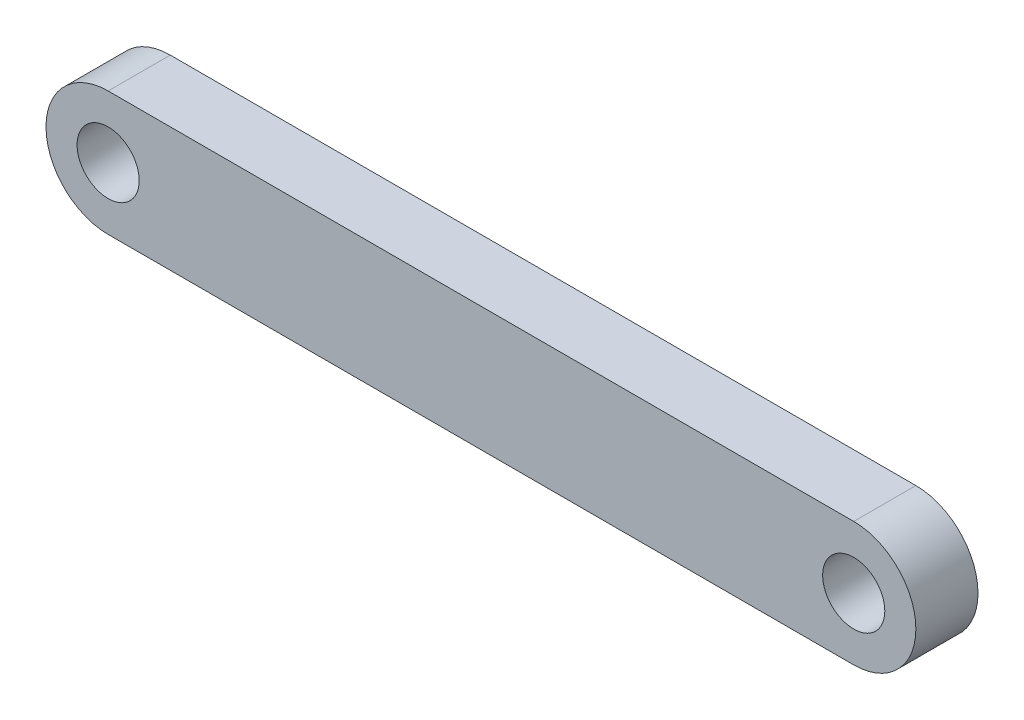
ISO-10303-21;
HEADER;
FILE_DESCRIPTION(('STEP AP214'),'2;1');
FILE_NAME('part.step','',(''),(''),'','','');
FILE_SCHEMA(('AUTOMOTIVE_DESIGN { 1 0 10303 214 1 1 1 1 }'));
ENDSEC;
DATA;
#1=APPLICATION_CONTEXT('core data for automotive mechanical design processes');
#2=APPLICATION_PROTOCOL_DEFINITION('international standard','automotive_design',2000,#1);
#3=PRODUCT_CONTEXT('',#1,'mechanical');
#4=PRODUCT('Part','Part','',(#3));
#5=PRODUCT_RELATED_PRODUCT_CATEGORY('part','',(#4));
#6=PRODUCT_DEFINITION_FORMATION('','',#4);
#7=PRODUCT_DEFINITION_CONTEXT('part definition',#1,'design');
#8=PRODUCT_DEFINITION('design','',#6,#7);
#9=PRODUCT_DEFINITION_SHAPE('','',#8);
#10=(LENGTH_UNIT() NAMED_UNIT(*) SI_UNIT(.MILLI.,.METRE.));
#11=(NAMED_UNIT(*) PLANE_ANGLE_UNIT() SI_UNIT($,.RADIAN.));
#12=(NAMED_UNIT(*) SI_UNIT($,.STERADIAN.) SOLID_ANGLE_UNIT());
#13=UNCERTAINTY_MEASURE_WITH_UNIT(LENGTH_MEASURE(1.E-05),#10,'distance_accuracy_value','');
#14=(GEOMETRIC_REPRESENTATION_CONTEXT(3) GLOBAL_UNCERTAINTY_ASSIGNED_CONTEXT((#13)) GLOBAL_UNIT_ASSIGNED_CONTEXT((#10,
#11,#12)) REPRESENTATION_CONTEXT('',''));
#15=CARTESIAN_POINT('',(0.,0.,0.));
#16=DIRECTION('',(0.,0.,1.));
#17=DIRECTION('',(1.,0.,0.));
#18=AXIS2_PLACEMENT_3D('',#15,#16,#17);
#19=CARTESIAN_POINT('',(0.,0.,6.35));
#20=DIRECTION('',(0.,1.,0.));
#21=DIRECTION('',(-1.,0.,0.));
#22=AXIS2_PLACEMENT_3D('',#19,#20,#21);
#23=PLANE('',#22);
#24=DIRECTION('',(1.,0.,0.));
#25=VECTOR('',#24,1.);
#26=CARTESIAN_POINT('',(0.,0.,0.));
#27=LINE('',#26,#25);
#28=CARTESIAN_POINT('',(0.,0.,0.));
#29=VERTEX_POINT('',#28);
#30=CARTESIAN_POINT('',(76.2,0.,0.));
#31=VERTEX_POINT('',#30);
#32=EDGE_CURVE('E104',#29,#31,#27,.T.);
#33=ORIENTED_EDGE('',*,*,#32,.T.);
#34=DIRECTION('',(0.,0.,-1.));
#35=VECTOR('',#34,1.);
#36=CARTESIAN_POINT('',(76.2,0.,6.35));
#37=LINE('',#36,#35);
#38=CARTESIAN_POINT('',(76.2,0.,6.35));
#39=VERTEX_POINT('',#38);
#40=EDGE_CURVE('E11',#39,#31,#37,.T.);
#41=ORIENTED_EDGE('',*,*,#40,.F.);
#42=DIRECTION('',(1.,0.,0.));
#43=VECTOR('',#42,1.);
#44=CARTESIAN_POINT('',(0.,0.,6.35));
#45=LINE('',#44,#43);
#46=CARTESIAN_POINT('',(0.,0.,6.35));
#47=VERTEX_POINT('',#46);
#48=EDGE_CURVE('E86',#47,#39,#45,.T.);
#49=ORIENTED_EDGE('',*,*,#48,.F.);
#50=DIRECTION('',(0.,0.,-1.));
#51=VECTOR('',#50,1.);
#52=CARTESIAN_POINT('',(0.,0.,6.35));
#53=LINE('',#52,#51);
#54=EDGE_CURVE('E94',#47,#29,#53,.T.);
#55=ORIENTED_EDGE('',*,*,#54,.T.);
#56=EDGE_LOOP('',(#33,#41,#49,#55));
#57=FACE_BOUND('',#56,.T.);
#58=ADVANCED_FACE('F34',(#57),#23,.F.);
#59=CARTESIAN_POINT('',(76.2,6.35,6.35));
#60=DIRECTION('',(0.,0.,-1.));
#61=DIRECTION('',(-1.,0.,0.));
#62=AXIS2_PLACEMENT_3D('',#59,#60,#61);
#63=CYLINDRICAL_SURFACE('',#62,6.35);
#64=CARTESIAN_POINT('',(76.2,6.35,0.));
#65=DIRECTION('',(0.,0.,1.));
#66=DIRECTION('',(1.,0.,0.));
#67=AXIS2_PLACEMENT_3D('',#64,#65,#66);
#68=CIRCLE('',#67,6.35);
#69=CARTESIAN_POINT('',(76.2,12.7,0.));
#70=VERTEX_POINT('',#69);
#71=EDGE_CURVE('E90',#31,#70,#68,.T.);
#72=ORIENTED_EDGE('',*,*,#71,.T.);
#73=DIRECTION('',(0.,0.,-1.));
#74=VECTOR('',#73,1.);
#75=CARTESIAN_POINT('',(76.2,12.7,6.35));
#76=LINE('',#75,#74);
#77=CARTESIAN_POINT('',(76.2,12.7,6.35));
#78=VERTEX_POINT('',#77);
#79=EDGE_CURVE('E43',#78,#70,#76,.T.);
#80=ORIENTED_EDGE('',*,*,#79,.F.);
#81=CARTESIAN_POINT('',(76.2,6.35,6.35));
#82=DIRECTION('',(0.,0.,1.));
#83=DIRECTION('',(1.,0.,0.));
#84=AXIS2_PLACEMENT_3D('',#81,#82,#83);
#85=CIRCLE('',#84,6.35);
#86=EDGE_CURVE('E81',#39,#78,#85,.T.);
#87=ORIENTED_EDGE('',*,*,#86,.F.);
#88=ORIENTED_EDGE('',*,*,#40,.T.);
#89=EDGE_LOOP('',(#72,#80,#87,#88));
#90=FACE_BOUND('',#89,.T.);
#91=ADVANCED_FACE('F89',(#90),#63,.T.);
#92=CARTESIAN_POINT('',(0.,12.7,6.35));
#93=DIRECTION('',(0.,-1.,0.));
#94=DIRECTION('',(0.,0.,-1.));
#95=AXIS2_PLACEMENT_3D('',#92,#93,#94);
#96=PLANE('',#95);
#97=DIRECTION('',(-1.,0.,0.));
#98=VECTOR('',#97,1.);
#99=CARTESIAN_POINT('',(0.,12.7,0.));
#100=LINE('',#99,#98);
#101=CARTESIAN_POINT('',(0.,12.7,0.));
#102=VERTEX_POINT('',#101);
#103=EDGE_CURVE('E68',#70,#102,#100,.T.);
#104=ORIENTED_EDGE('',*,*,#103,.T.);
#105=DIRECTION('',(0.,0.,-1.));
#106=VECTOR('',#105,1.);
#107=CARTESIAN_POINT('',(0.,12.7,6.35));
#108=LINE('',#107,#106);
#109=CARTESIAN_POINT('',(0.,12.7,6.35));
#110=VERTEX_POINT('',#109);
#111=EDGE_CURVE('E91',#110,#102,#108,.T.);
#112=ORIENTED_EDGE('',*,*,#111,.F.);
#113=DIRECTION('',(-1.,0.,0.));
#114=VECTOR('',#113,1.);
#115=CARTESIAN_POINT('',(0.,12.7,6.35));
#116=LINE('',#115,#114);
#117=EDGE_CURVE('E84',#78,#110,#116,.T.);
#118=ORIENTED_EDGE('',*,*,#117,.F.);
#119=ORIENTED_EDGE('',*,*,#79,.T.);
#120=EDGE_LOOP('',(#104,#112,#118,#119));
#121=FACE_BOUND('',#120,.T.);
#122=ADVANCED_FACE('F92',(#121),#96,.F.);
#123=CARTESIAN_POINT('',(0.,6.35,6.35));
#124=DIRECTION('',(0.,0.,-1.));
#125=DIRECTION('',(-1.,0.,0.));
#126=AXIS2_PLACEMENT_3D('',#123,#124,#125);
#127=CYLINDRICAL_SURFACE('',#126,3.175);
#128=CARTESIAN_POINT('',(0.,6.35,6.35));
#129=DIRECTION('',(0.,0.,1.));
#130=DIRECTION('',(1.,0.,0.));
#131=AXIS2_PLACEMENT_3D('',#128,#129,#130);
#132=CIRCLE('',#131,3.175);
#133=CARTESIAN_POINT('',(3.175,6.35,6.35));
#134=VERTEX_POINT('',#133);
#135=EDGE_CURVE('E117',#134,#134,#132,.T.);
#136=ORIENTED_EDGE('',*,*,#135,.T.);
#137=EDGE_LOOP('',(#136));
#138=FACE_BOUND('',#137,.T.);
#139=CARTESIAN_POINT('',(0.,6.35,0.));
#140=DIRECTION('',(0.,0.,1.));
#141=DIRECTION('',(1.,0.,0.));
#142=AXIS2_PLACEMENT_3D('',#139,#140,#141);
#143=CIRCLE('',#142,3.175);
#144=CARTESIAN_POINT('',(3.175,6.35,0.));
#145=VERTEX_POINT('',#144);
#146=EDGE_CURVE('E101',#145,#145,#143,.T.);
#147=ORIENTED_EDGE('',*,*,#146,.F.);
#148=EDGE_LOOP('',(#147));
#149=FACE_BOUND('',#148,.T.);
#150=ADVANCED_FACE('F131',(#138,#149),#127,.F.);
#151=CARTESIAN_POINT('',(76.2,6.35,6.35));
#152=DIRECTION('',(0.,0.,-1.));
#153=DIRECTION('',(-1.,0.,0.));
#154=AXIS2_PLACEMENT_3D('',#151,#152,#153);
#155=CYLINDRICAL_SURFACE('',#154,3.175);
#156=CARTESIAN_POINT('',(76.2,6.35,6.35));
#157=DIRECTION('',(0.,0.,1.));
#158=DIRECTION('',(1.,0.,0.));
#159=AXIS2_PLACEMENT_3D('',#156,#157,#158);
#160=CIRCLE('',#159,3.175);
#161=CARTESIAN_POINT('',(79.375,6.35,6.35));
#162=VERTEX_POINT('',#161);
#163=EDGE_CURVE('E110',#162,#162,#160,.T.);
#164=ORIENTED_EDGE('',*,*,#163,.T.);
#165=EDGE_LOOP('',(#164));
#166=FACE_BOUND('',#165,.T.);
#167=CARTESIAN_POINT('',(76.2,6.35,0.));
#168=DIRECTION('',(0.,0.,1.));
#169=DIRECTION('',(1.,0.,0.));
#170=AXIS2_PLACEMENT_3D('',#167,#168,#169);
#171=CIRCLE('',#170,3.175);
#172=CARTESIAN_POINT('',(79.375,6.35,0.));
#173=VERTEX_POINT('',#172);
#174=EDGE_CURVE('E98',#173,#173,#171,.T.);
#175=ORIENTED_EDGE('',*,*,#174,.F.);
#176=EDGE_LOOP('',(#175));
#177=FACE_BOUND('',#176,.T.);
#178=ADVANCED_FACE('F36',(#166,#177),#155,.F.);
#179=CARTESIAN_POINT('',(0.,6.35,6.35));
#180=DIRECTION('',(0.,0.,-1.));
#181=DIRECTION('',(-1.,0.,0.));
#182=AXIS2_PLACEMENT_3D('',#179,#180,#181);
#183=CYLINDRICAL_SURFACE('',#182,6.35);
#184=CARTESIAN_POINT('',(0.,6.35,0.));
#185=DIRECTION('',(0.,0.,1.));
#186=DIRECTION('',(1.,0.,0.));
#187=AXIS2_PLACEMENT_3D('',#184,#185,#186);
#188=CIRCLE('',#187,6.35);
#189=EDGE_CURVE('E74',#102,#29,#188,.T.);
#190=ORIENTED_EDGE('',*,*,#189,.T.);
#191=ORIENTED_EDGE('',*,*,#54,.F.);
#192=CARTESIAN_POINT('',(0.,6.35,6.35));
#193=DIRECTION('',(0.,0.,1.));
#194=DIRECTION('',(1.,0.,0.));
#195=AXIS2_PLACEMENT_3D('',#192,#193,#194);
#196=CIRCLE('',#195,6.35);
#197=EDGE_CURVE('E51',#110,#47,#196,.T.);
#198=ORIENTED_EDGE('',*,*,#197,.F.);
#199=ORIENTED_EDGE('',*,*,#111,.T.);
#200=EDGE_LOOP('',(#190,#191,#198,#199));
#201=FACE_BOUND('',#200,.T.);
#202=ADVANCED_FACE('F112',(#201),#183,.T.);
#203=CARTESIAN_POINT('',(0.,0.,6.35));
#204=DIRECTION('',(0.,0.,1.));
#205=DIRECTION('',(1.,0.,0.));
#206=AXIS2_PLACEMENT_3D('',#203,#204,#205);
#207=PLANE('',#206);
#208=ORIENTED_EDGE('',*,*,#163,.F.);
#209=EDGE_LOOP('',(#208));
#210=FACE_BOUND('',#209,.T.);
#211=ORIENTED_EDGE('',*,*,#135,.F.);
#212=EDGE_LOOP('',(#211));
#213=FACE_BOUND('',#212,.T.);
#214=ORIENTED_EDGE('',*,*,#48,.T.);
#215=ORIENTED_EDGE('',*,*,#86,.T.);
#216=ORIENTED_EDGE('',*,*,#117,.T.);
#217=ORIENTED_EDGE('',*,*,#197,.T.);
#218=EDGE_LOOP('',(#214,#215,#216,#217));
#219=FACE_BOUND('',#218,.T.);
#220=ADVANCED_FACE('F82',(#210,#213,#219),#207,.T.);
#221=CARTESIAN_POINT('',(0.,0.,0.));
#222=DIRECTION('',(0.,0.,1.));
#223=DIRECTION('',(1.,0.,0.));
#224=AXIS2_PLACEMENT_3D('',#221,#222,#223);
#225=PLANE('',#224);
#226=ORIENTED_EDGE('',*,*,#174,.T.);
#227=EDGE_LOOP('',(#226));
#228=FACE_BOUND('',#227,.T.);
#229=ORIENTED_EDGE('',*,*,#146,.T.);
#230=EDGE_LOOP('',(#229));
#231=FACE_BOUND('',#230,.T.);
#232=ORIENTED_EDGE('',*,*,#32,.F.);
#233=ORIENTED_EDGE('',*,*,#189,.F.);
#234=ORIENTED_EDGE('',*,*,#103,.F.);
#235=ORIENTED_EDGE('',*,*,#71,.F.);
#236=EDGE_LOOP('',(#232,#233,#234,#235));
#237=FACE_BOUND('',#236,.T.);
#238=ADVANCED_FACE('F115',(#228,#231,#237),#225,.F.);
#239=CLOSED_SHELL('',(#58,#91,#122,#150,#178,#202,#220,#238));
#240=MANIFOLD_SOLID_BREP('B2',#239);
#241=ADVANCED_BREP_SHAPE_REPRESENTATION('',(#18,#240),#14);
#242=SHAPE_DEFINITION_REPRESENTATION(#9,#241);
ENDSEC;
END-ISO-10303-21;
